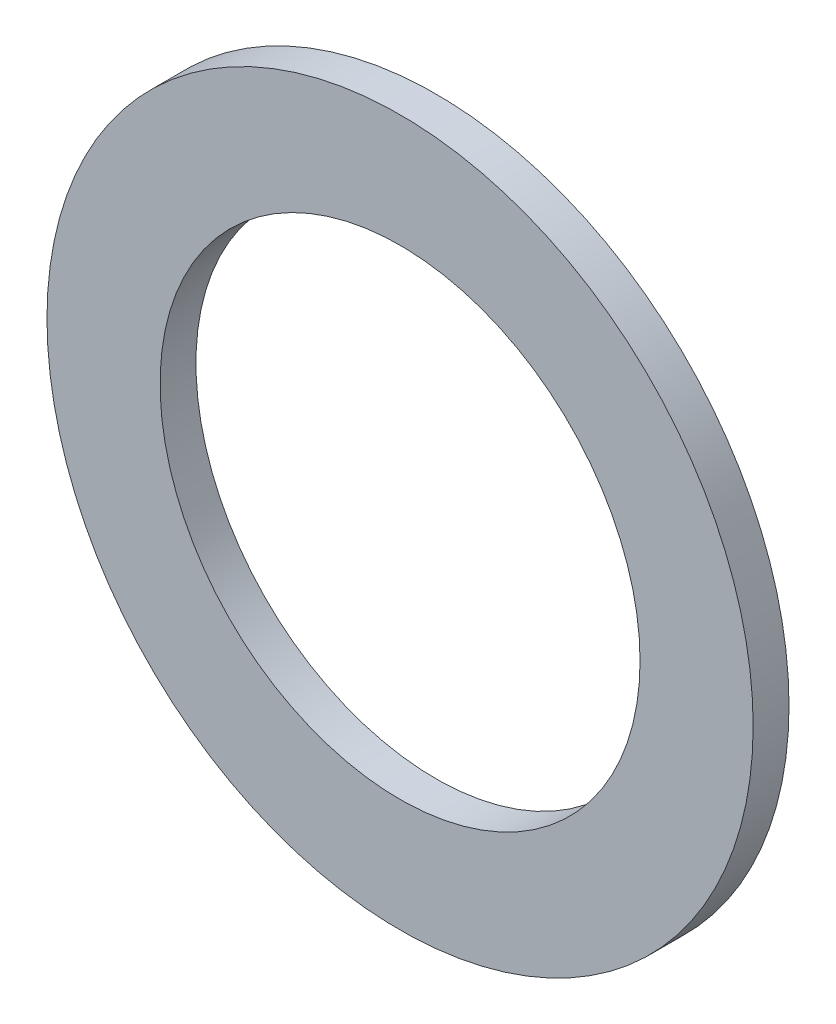
ISO-10303-21;
HEADER;
FILE_DESCRIPTION(('STEP AP214'),'2;1');
FILE_NAME('part.step','',(''),(''),'','','');
FILE_SCHEMA(('AUTOMOTIVE_DESIGN { 1 0 10303 214 1 1 1 1 }'));
ENDSEC;
DATA;
#1=APPLICATION_CONTEXT('core data for automotive mechanical design processes');
#2=APPLICATION_PROTOCOL_DEFINITION('international standard','automotive_design',2000,#1);
#3=PRODUCT_CONTEXT('',#1,'mechanical');
#4=PRODUCT('Part','Part','',(#3));
#5=PRODUCT_RELATED_PRODUCT_CATEGORY('part','',(#4));
#6=PRODUCT_DEFINITION_FORMATION('','',#4);
#7=PRODUCT_DEFINITION_CONTEXT('part definition',#1,'design');
#8=PRODUCT_DEFINITION('design','',#6,#7);
#9=PRODUCT_DEFINITION_SHAPE('','',#8);
#10=(LENGTH_UNIT() NAMED_UNIT(*) SI_UNIT(.MILLI.,.METRE.));
#11=(NAMED_UNIT(*) PLANE_ANGLE_UNIT() SI_UNIT($,.RADIAN.));
#12=(NAMED_UNIT(*) SI_UNIT($,.STERADIAN.) SOLID_ANGLE_UNIT());
#13=UNCERTAINTY_MEASURE_WITH_UNIT(LENGTH_MEASURE(1.E-05),#10,'distance_accuracy_value','');
#14=(GEOMETRIC_REPRESENTATION_CONTEXT(3) GLOBAL_UNCERTAINTY_ASSIGNED_CONTEXT((#13)) GLOBAL_UNIT_ASSIGNED_CONTEXT((#10,
#11,#12)) REPRESENTATION_CONTEXT('',''));
#15=CARTESIAN_POINT('',(0.,0.,0.));
#16=DIRECTION('',(0.,0.,1.));
#17=DIRECTION('',(1.,0.,0.));
#18=AXIS2_PLACEMENT_3D('',#15,#16,#17);
#19=CARTESIAN_POINT('',(0.,0.,13.));
#20=DIRECTION('',(0.,0.,1.));
#21=DIRECTION('',(1.,0.,0.));
#22=AXIS2_PLACEMENT_3D('',#19,#20,#21);
#23=PLANE('',#22);
#24=CARTESIAN_POINT('',(0.,0.,13.));
#25=DIRECTION('',(0.,0.,1.));
#26=DIRECTION('',(1.,0.,0.));
#27=AXIS2_PLACEMENT_3D('',#24,#25,#26);
#28=CIRCLE('',#27,128.);
#29=CARTESIAN_POINT('',(128.,0.,13.));
#30=VERTEX_POINT('',#29);
#31=EDGE_CURVE('E12',#30,#30,#28,.T.);
#32=ORIENTED_EDGE('',*,*,#31,.T.);
#33=EDGE_LOOP('',(#32));
#34=FACE_BOUND('',#33,.T.);
#35=CARTESIAN_POINT('',(0.,0.,13.));
#36=DIRECTION('',(0.,0.,1.));
#37=DIRECTION('',(1.,0.,0.));
#38=AXIS2_PLACEMENT_3D('',#35,#36,#37);
#39=CIRCLE('',#38,87.);
#40=CARTESIAN_POINT('',(87.,0.,13.));
#41=VERTEX_POINT('',#40);
#42=EDGE_CURVE('E54',#41,#41,#39,.T.);
#43=ORIENTED_EDGE('',*,*,#42,.F.);
#44=EDGE_LOOP('',(#43));
#45=FACE_BOUND('',#44,.T.);
#46=ADVANCED_FACE('F43',(#34,#45),#23,.T.);
#47=CARTESIAN_POINT('',(0.,0.,0.));
#48=DIRECTION('',(0.,0.,1.));
#49=DIRECTION('',(1.,0.,0.));
#50=AXIS2_PLACEMENT_3D('',#47,#48,#49);
#51=PLANE('',#50);
#52=CARTESIAN_POINT('',(0.,0.,0.));
#53=DIRECTION('',(0.,0.,1.));
#54=DIRECTION('',(1.,0.,0.));
#55=AXIS2_PLACEMENT_3D('',#52,#53,#54);
#56=CIRCLE('',#55,128.);
#57=CARTESIAN_POINT('',(128.,0.,0.));
#58=VERTEX_POINT('',#57);
#59=EDGE_CURVE('E47',#58,#58,#56,.T.);
#60=ORIENTED_EDGE('',*,*,#59,.F.);
#61=EDGE_LOOP('',(#60));
#62=FACE_BOUND('',#61,.T.);
#63=CARTESIAN_POINT('',(0.,0.,0.));
#64=DIRECTION('',(0.,0.,1.));
#65=DIRECTION('',(1.,0.,0.));
#66=AXIS2_PLACEMENT_3D('',#63,#64,#65);
#67=CIRCLE('',#66,87.);
#68=CARTESIAN_POINT('',(87.,0.,0.));
#69=VERTEX_POINT('',#68);
#70=EDGE_CURVE('E56',#69,#69,#67,.T.);
#71=ORIENTED_EDGE('',*,*,#70,.T.);
#72=EDGE_LOOP('',(#71));
#73=FACE_BOUND('',#72,.T.);
#74=ADVANCED_FACE('F66',(#62,#73),#51,.F.);
#75=CARTESIAN_POINT('',(0.,0.,13.));
#76=DIRECTION('',(0.,0.,-1.));
#77=DIRECTION('',(-1.,0.,0.));
#78=AXIS2_PLACEMENT_3D('',#75,#76,#77);
#79=CYLINDRICAL_SURFACE('',#78,128.);
#80=ORIENTED_EDGE('',*,*,#31,.F.);
#81=EDGE_LOOP('',(#80));
#82=FACE_BOUND('',#81,.T.);
#83=ORIENTED_EDGE('',*,*,#59,.T.);
#84=EDGE_LOOP('',(#83));
#85=FACE_BOUND('',#84,.T.);
#86=ADVANCED_FACE('F45',(#82,#85),#79,.T.);
#87=CARTESIAN_POINT('',(0.,0.,13.));
#88=DIRECTION('',(0.,0.,-1.));
#89=DIRECTION('',(-1.,0.,0.));
#90=AXIS2_PLACEMENT_3D('',#87,#88,#89);
#91=CYLINDRICAL_SURFACE('',#90,87.);
#92=ORIENTED_EDGE('',*,*,#42,.T.);
#93=EDGE_LOOP('',(#92));
#94=FACE_BOUND('',#93,.T.);
#95=ORIENTED_EDGE('',*,*,#70,.F.);
#96=EDGE_LOOP('',(#95));
#97=FACE_BOUND('',#96,.T.);
#98=ADVANCED_FACE('F62',(#94,#97),#91,.F.);
#99=CLOSED_SHELL('',(#46,#74,#86,#98));
#100=MANIFOLD_SOLID_BREP('B2',#99);
#101=ADVANCED_BREP_SHAPE_REPRESENTATION('',(#18,#100),#14);
#102=SHAPE_DEFINITION_REPRESENTATION(#9,#101);
ENDSEC;
END-ISO-10303-21;
